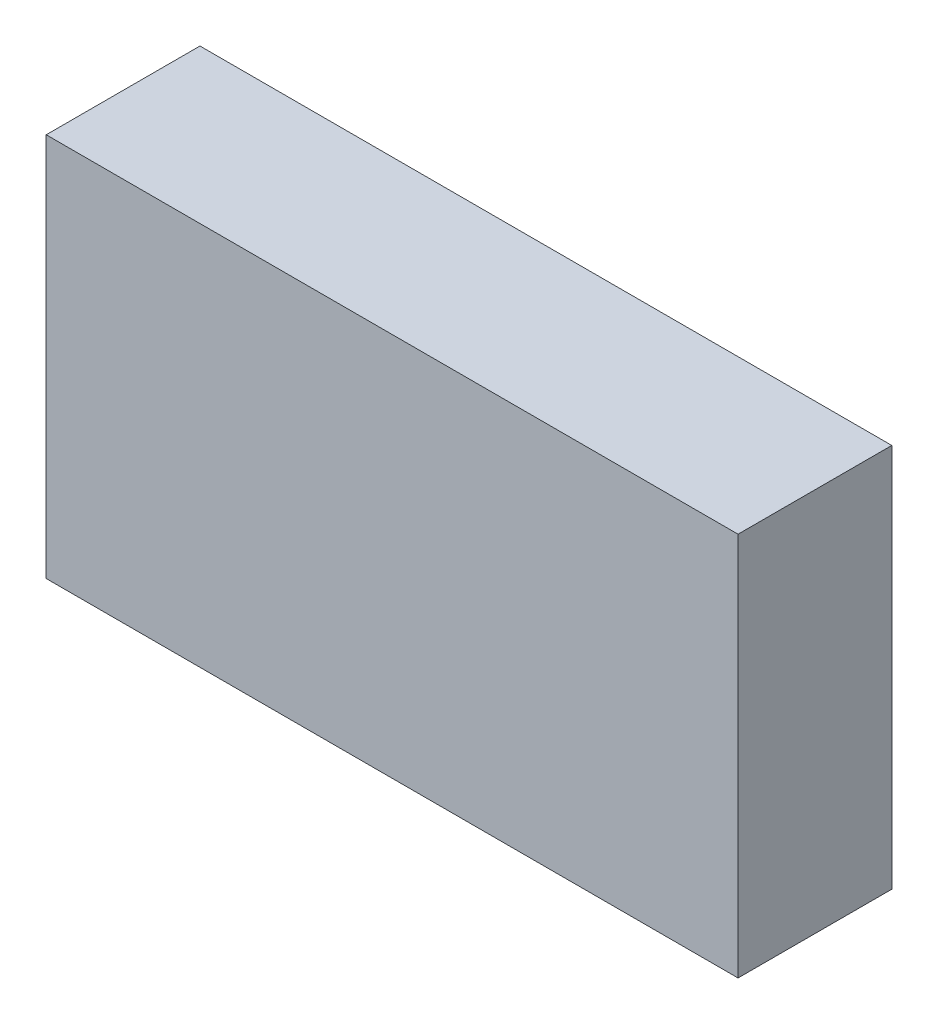
ISO-10303-21;
HEADER;
FILE_DESCRIPTION(('STEP AP214'),'2;1');
FILE_NAME('part.step','',(''),(''),'','','');
FILE_SCHEMA(('AUTOMOTIVE_DESIGN { 1 0 10303 214 1 1 1 1 }'));
ENDSEC;
DATA;
#1=APPLICATION_CONTEXT('core data for automotive mechanical design processes');
#2=APPLICATION_PROTOCOL_DEFINITION('international standard','automotive_design',2000,#1);
#3=PRODUCT_CONTEXT('',#1,'mechanical');
#4=PRODUCT('Part','Part','',(#3));
#5=PRODUCT_RELATED_PRODUCT_CATEGORY('part','',(#4));
#6=PRODUCT_DEFINITION_FORMATION('','',#4);
#7=PRODUCT_DEFINITION_CONTEXT('part definition',#1,'design');
#8=PRODUCT_DEFINITION('design','',#6,#7);
#9=PRODUCT_DEFINITION_SHAPE('','',#8);
#10=(LENGTH_UNIT() NAMED_UNIT(*) SI_UNIT(.MILLI.,.METRE.));
#11=(NAMED_UNIT(*) PLANE_ANGLE_UNIT() SI_UNIT($,.RADIAN.));
#12=(NAMED_UNIT(*) SI_UNIT($,.STERADIAN.) SOLID_ANGLE_UNIT());
#13=UNCERTAINTY_MEASURE_WITH_UNIT(LENGTH_MEASURE(1.E-05),#10,'distance_accuracy_value','');
#14=(GEOMETRIC_REPRESENTATION_CONTEXT(3) GLOBAL_UNCERTAINTY_ASSIGNED_CONTEXT((#13)) GLOBAL_UNIT_ASSIGNED_CONTEXT((#10,
#11,#12)) REPRESENTATION_CONTEXT('',''));
#15=CARTESIAN_POINT('',(0.,0.,0.));
#16=DIRECTION('',(0.,0.,1.));
#17=DIRECTION('',(1.,0.,0.));
#18=AXIS2_PLACEMENT_3D('',#15,#16,#17);
#19=CARTESIAN_POINT('',(-2.05,-0.125,0.));
#20=DIRECTION('',(1.,0.,0.));
#21=DIRECTION('',(0.,0.,1.));
#22=AXIS2_PLACEMENT_3D('',#19,#20,#21);
#23=PLANE('',#22);
#24=DIRECTION('',(0.,1.,0.));
#25=VECTOR('',#24,1.);
#26=CARTESIAN_POINT('',(-2.05,-0.125,0.1));
#27=LINE('',#26,#25);
#28=CARTESIAN_POINT('',(-2.05,-0.125,0.1));
#29=VERTEX_POINT('',#28);
#30=CARTESIAN_POINT('',(-2.05,0.125,0.1));
#31=VERTEX_POINT('',#30);
#32=EDGE_CURVE('E11',#29,#31,#27,.T.);
#33=ORIENTED_EDGE('',*,*,#32,.T.);
#34=DIRECTION('',(0.,0.,1.));
#35=VECTOR('',#34,1.);
#36=CARTESIAN_POINT('',(-2.05,0.125,0.));
#37=LINE('',#36,#35);
#38=CARTESIAN_POINT('',(-2.05,0.125,0.));
#39=VERTEX_POINT('',#38);
#40=EDGE_CURVE('E24',#39,#31,#37,.T.);
#41=ORIENTED_EDGE('',*,*,#40,.F.);
#42=DIRECTION('',(0.,1.,0.));
#43=VECTOR('',#42,1.);
#44=CARTESIAN_POINT('',(-2.05,-0.125,0.));
#45=LINE('',#44,#43);
#46=CARTESIAN_POINT('',(-2.05,-0.125,0.));
#47=VERTEX_POINT('',#46);
#48=EDGE_CURVE('E86',#47,#39,#45,.T.);
#49=ORIENTED_EDGE('',*,*,#48,.F.);
#50=DIRECTION('',(0.,0.,1.));
#51=VECTOR('',#50,1.);
#52=CARTESIAN_POINT('',(-2.05,-0.125,0.));
#53=LINE('',#52,#51);
#54=EDGE_CURVE('E36',#47,#29,#53,.T.);
#55=ORIENTED_EDGE('',*,*,#54,.T.);
#56=EDGE_LOOP('',(#33,#41,#49,#55));
#57=FACE_BOUND('',#56,.T.);
#58=ADVANCED_FACE('F17',(#57),#23,.F.);
#59=CARTESIAN_POINT('',(-1.6,-0.125,0.));
#60=DIRECTION('',(1.,0.,0.));
#61=DIRECTION('',(0.,0.,1.));
#62=AXIS2_PLACEMENT_3D('',#59,#60,#61);
#63=PLANE('',#62);
#64=DIRECTION('',(0.,0.,1.));
#65=VECTOR('',#64,1.);
#66=CARTESIAN_POINT('',(-1.6,-0.125,0.));
#67=LINE('',#66,#65);
#68=CARTESIAN_POINT('',(-1.6,-0.125,0.));
#69=VERTEX_POINT('',#68);
#70=CARTESIAN_POINT('',(-1.6,-0.125,0.1));
#71=VERTEX_POINT('',#70);
#72=EDGE_CURVE('E83',#69,#71,#67,.T.);
#73=ORIENTED_EDGE('',*,*,#72,.F.);
#74=DIRECTION('',(0.,1.,0.));
#75=VECTOR('',#74,1.);
#76=CARTESIAN_POINT('',(-1.6,-0.125,0.));
#77=LINE('',#76,#75);
#78=CARTESIAN_POINT('',(-1.6,0.125,0.));
#79=VERTEX_POINT('',#78);
#80=EDGE_CURVE('E63',#69,#79,#77,.T.);
#81=ORIENTED_EDGE('',*,*,#80,.T.);
#82=DIRECTION('',(0.,0.,1.));
#83=VECTOR('',#82,1.);
#84=CARTESIAN_POINT('',(-1.6,0.125,0.));
#85=LINE('',#84,#83);
#86=CARTESIAN_POINT('',(-1.6,0.125,0.1));
#87=VERTEX_POINT('',#86);
#88=EDGE_CURVE('E57',#79,#87,#85,.T.);
#89=ORIENTED_EDGE('',*,*,#88,.T.);
#90=DIRECTION('',(0.,1.,0.));
#91=VECTOR('',#90,1.);
#92=CARTESIAN_POINT('',(-1.6,-0.125,0.1));
#93=LINE('',#92,#91);
#94=EDGE_CURVE('E60',#71,#87,#93,.T.);
#95=ORIENTED_EDGE('',*,*,#94,.F.);
#96=EDGE_LOOP('',(#73,#81,#89,#95));
#97=FACE_BOUND('',#96,.T.);
#98=ADVANCED_FACE('F59',(#97),#63,.T.);
#99=CARTESIAN_POINT('',(-2.05,-0.125,0.));
#100=DIRECTION('',(0.,1.,0.));
#101=DIRECTION('',(0.,0.,1.));
#102=AXIS2_PLACEMENT_3D('',#99,#100,#101);
#103=PLANE('',#102);
#104=ORIENTED_EDGE('',*,*,#72,.T.);
#105=DIRECTION('',(1.,0.,0.));
#106=VECTOR('',#105,1.);
#107=CARTESIAN_POINT('',(-2.05,-0.125,0.1));
#108=LINE('',#107,#106);
#109=EDGE_CURVE('E71',#29,#71,#108,.T.);
#110=ORIENTED_EDGE('',*,*,#109,.F.);
#111=ORIENTED_EDGE('',*,*,#54,.F.);
#112=DIRECTION('',(1.,0.,0.));
#113=VECTOR('',#112,1.);
#114=CARTESIAN_POINT('',(-2.05,-0.125,0.));
#115=LINE('',#114,#113);
#116=EDGE_CURVE('E76',#47,#69,#115,.T.);
#117=ORIENTED_EDGE('',*,*,#116,.T.);
#118=EDGE_LOOP('',(#104,#110,#111,#117));
#119=FACE_BOUND('',#118,.T.);
#120=ADVANCED_FACE('F91',(#119),#103,.F.);
#121=CARTESIAN_POINT('',(-2.05,0.125,0.));
#122=DIRECTION('',(0.,1.,0.));
#123=DIRECTION('',(0.,0.,1.));
#124=AXIS2_PLACEMENT_3D('',#121,#122,#123);
#125=PLANE('',#124);
#126=DIRECTION('',(1.,0.,0.));
#127=VECTOR('',#126,1.);
#128=CARTESIAN_POINT('',(-2.05,0.125,0.));
#129=LINE('',#128,#127);
#130=EDGE_CURVE('E74',#39,#79,#129,.T.);
#131=ORIENTED_EDGE('',*,*,#130,.F.);
#132=ORIENTED_EDGE('',*,*,#40,.T.);
#133=DIRECTION('',(1.,0.,0.));
#134=VECTOR('',#133,1.);
#135=CARTESIAN_POINT('',(-2.05,0.125,0.1));
#136=LINE('',#135,#134);
#137=EDGE_CURVE('E69',#31,#87,#136,.T.);
#138=ORIENTED_EDGE('',*,*,#137,.T.);
#139=ORIENTED_EDGE('',*,*,#88,.F.);
#140=EDGE_LOOP('',(#131,#132,#138,#139));
#141=FACE_BOUND('',#140,.T.);
#142=ADVANCED_FACE('F73',(#141),#125,.T.);
#143=CARTESIAN_POINT('',(-2.05,-0.125,0.));
#144=DIRECTION('',(0.,0.,1.));
#145=DIRECTION('',(1.,0.,0.));
#146=AXIS2_PLACEMENT_3D('',#143,#144,#145);
#147=PLANE('',#146);
#148=ORIENTED_EDGE('',*,*,#130,.T.);
#149=ORIENTED_EDGE('',*,*,#80,.F.);
#150=ORIENTED_EDGE('',*,*,#116,.F.);
#151=ORIENTED_EDGE('',*,*,#48,.T.);
#152=EDGE_LOOP('',(#148,#149,#150,#151));
#153=FACE_BOUND('',#152,.T.);
#154=ADVANCED_FACE('F89',(#153),#147,.F.);
#155=CARTESIAN_POINT('',(-2.05,-0.125,0.1));
#156=DIRECTION('',(0.,0.,1.));
#157=DIRECTION('',(1.,0.,0.));
#158=AXIS2_PLACEMENT_3D('',#155,#156,#157);
#159=PLANE('',#158);
#160=ORIENTED_EDGE('',*,*,#32,.F.);
#161=ORIENTED_EDGE('',*,*,#109,.T.);
#162=ORIENTED_EDGE('',*,*,#94,.T.);
#163=ORIENTED_EDGE('',*,*,#137,.F.);
#164=EDGE_LOOP('',(#160,#161,#162,#163));
#165=FACE_BOUND('',#164,.T.);
#166=ADVANCED_FACE('F68',(#165),#159,.T.);
#167=CLOSED_SHELL('',(#58,#98,#120,#142,#154,#166));
#168=MANIFOLD_SOLID_BREP('B1',#167);
#169=ADVANCED_BREP_SHAPE_REPRESENTATION('',(#18,#168),#14);
#170=SHAPE_DEFINITION_REPRESENTATION(#9,#169);
ENDSEC;
END-ISO-10303-21;
